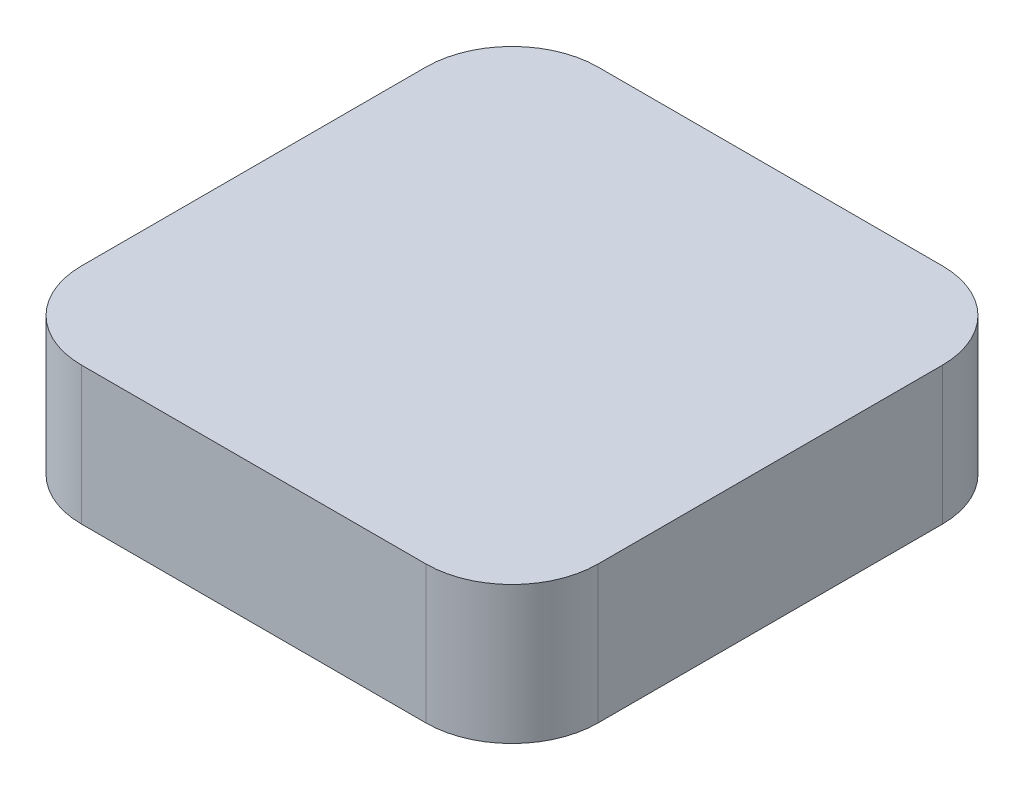
ISO-10303-21;
HEADER;
FILE_DESCRIPTION(('STEP AP214'),'2;1');
FILE_NAME('part.step','',(''),(''),'','','');
FILE_SCHEMA(('AUTOMOTIVE_DESIGN { 1 0 10303 214 1 1 1 1 }'));
ENDSEC;
DATA;
#1=APPLICATION_CONTEXT('core data for automotive mechanical design processes');
#2=APPLICATION_PROTOCOL_DEFINITION('international standard','automotive_design',2000,#1);
#3=PRODUCT_CONTEXT('',#1,'mechanical');
#4=PRODUCT('Part','Part','',(#3));
#5=PRODUCT_RELATED_PRODUCT_CATEGORY('part','',(#4));
#6=PRODUCT_DEFINITION_FORMATION('','',#4);
#7=PRODUCT_DEFINITION_CONTEXT('part definition',#1,'design');
#8=PRODUCT_DEFINITION('design','',#6,#7);
#9=PRODUCT_DEFINITION_SHAPE('','',#8);
#10=(LENGTH_UNIT() NAMED_UNIT(*) SI_UNIT(.MILLI.,.METRE.));
#11=(NAMED_UNIT(*) PLANE_ANGLE_UNIT() SI_UNIT($,.RADIAN.));
#12=(NAMED_UNIT(*) SI_UNIT($,.STERADIAN.) SOLID_ANGLE_UNIT());
#13=UNCERTAINTY_MEASURE_WITH_UNIT(LENGTH_MEASURE(1.E-05),#10,'distance_accuracy_value','');
#14=(GEOMETRIC_REPRESENTATION_CONTEXT(3) GLOBAL_UNCERTAINTY_ASSIGNED_CONTEXT((#13)) GLOBAL_UNIT_ASSIGNED_CONTEXT((#10,
#11,#12)) REPRESENTATION_CONTEXT('',''));
#15=CARTESIAN_POINT('',(0.,0.,0.));
#16=DIRECTION('',(0.,0.,1.));
#17=DIRECTION('',(1.,0.,0.));
#18=AXIS2_PLACEMENT_3D('',#15,#16,#17);
#19=CARTESIAN_POINT('',(5.,4.,5.));
#20=DIRECTION('',(0.,-1.,0.));
#21=DIRECTION('',(0.,0.,-1.));
#22=AXIS2_PLACEMENT_3D('',#19,#20,#21);
#23=CYLINDRICAL_SURFACE('',#22,2.5);
#24=CARTESIAN_POINT('',(5.,0.,5.));
#25=DIRECTION('',(0.,1.,0.));
#26=DIRECTION('',(0.,0.,-1.));
#27=AXIS2_PLACEMENT_3D('',#24,#25,#26);
#28=CIRCLE('',#27,2.5);
#29=CARTESIAN_POINT('',(4.99999999999998,0.,7.5));
#30=VERTEX_POINT('',#29);
#31=CARTESIAN_POINT('',(7.5,0.,4.99999999999998));
#32=VERTEX_POINT('',#31);
#33=EDGE_CURVE('E134',#30,#32,#28,.T.);
#34=ORIENTED_EDGE('',*,*,#33,.T.);
#35=DIRECTION('',(0.,-1.,0.));
#36=VECTOR('',#35,1.);
#37=CARTESIAN_POINT('',(7.5,4.,4.99999999999998));
#38=LINE('',#37,#36);
#39=CARTESIAN_POINT('',(7.5,4.,4.99999999999998));
#40=VERTEX_POINT('',#39);
#41=EDGE_CURVE('E11',#40,#32,#38,.T.);
#42=ORIENTED_EDGE('',*,*,#41,.F.);
#43=CARTESIAN_POINT('',(5.,4.,5.));
#44=DIRECTION('',(0.,1.,0.));
#45=DIRECTION('',(0.,0.,-1.));
#46=AXIS2_PLACEMENT_3D('',#43,#44,#45);
#47=CIRCLE('',#46,2.5);
#48=CARTESIAN_POINT('',(4.99999999999998,4.,7.5));
#49=VERTEX_POINT('',#48);
#50=EDGE_CURVE('E148',#49,#40,#47,.T.);
#51=ORIENTED_EDGE('',*,*,#50,.F.);
#52=DIRECTION('',(0.,-1.,0.));
#53=VECTOR('',#52,1.);
#54=CARTESIAN_POINT('',(4.99999999999998,4.,7.5));
#55=LINE('',#54,#53);
#56=EDGE_CURVE('E130',#49,#30,#55,.T.);
#57=ORIENTED_EDGE('',*,*,#56,.T.);
#58=EDGE_LOOP('',(#34,#42,#51,#57));
#59=FACE_BOUND('',#58,.T.);
#60=ADVANCED_FACE('F38',(#59),#23,.T.);
#61=CARTESIAN_POINT('',(7.5,4.,-4.99999999999998));
#62=DIRECTION('',(-1.,0.,0.));
#63=DIRECTION('',(0.,0.,1.));
#64=AXIS2_PLACEMENT_3D('',#61,#62,#63);
#65=PLANE('',#64);
#66=DIRECTION('',(0.,0.,-1.));
#67=VECTOR('',#66,1.);
#68=CARTESIAN_POINT('',(7.5,0.,-4.99999999999998));
#69=LINE('',#68,#67);
#70=CARTESIAN_POINT('',(7.5,0.,-4.99999999999998));
#71=VERTEX_POINT('',#70);
#72=EDGE_CURVE('E137',#32,#71,#69,.T.);
#73=ORIENTED_EDGE('',*,*,#72,.T.);
#74=DIRECTION('',(0.,-1.,0.));
#75=VECTOR('',#74,1.);
#76=CARTESIAN_POINT('',(7.5,4.,-4.99999999999998));
#77=LINE('',#76,#75);
#78=CARTESIAN_POINT('',(7.5,4.,-4.99999999999998));
#79=VERTEX_POINT('',#78);
#80=EDGE_CURVE('E46',#79,#71,#77,.T.);
#81=ORIENTED_EDGE('',*,*,#80,.F.);
#82=DIRECTION('',(0.,0.,-1.));
#83=VECTOR('',#82,1.);
#84=CARTESIAN_POINT('',(7.5,4.,-4.99999999999998));
#85=LINE('',#84,#83);
#86=EDGE_CURVE('E97',#40,#79,#85,.T.);
#87=ORIENTED_EDGE('',*,*,#86,.F.);
#88=ORIENTED_EDGE('',*,*,#41,.T.);
#89=EDGE_LOOP('',(#73,#81,#87,#88));
#90=FACE_BOUND('',#89,.T.);
#91=ADVANCED_FACE('F183',(#90),#65,.F.);
#92=CARTESIAN_POINT('',(5.,4.,-5.));
#93=DIRECTION('',(0.,-1.,0.));
#94=DIRECTION('',(0.,0.,-1.));
#95=AXIS2_PLACEMENT_3D('',#92,#93,#94);
#96=CYLINDRICAL_SURFACE('',#95,2.5);
#97=CARTESIAN_POINT('',(5.,0.,-5.));
#98=DIRECTION('',(0.,1.,0.));
#99=DIRECTION('',(0.,0.,1.));
#100=AXIS2_PLACEMENT_3D('',#97,#98,#99);
#101=CIRCLE('',#100,2.5);
#102=CARTESIAN_POINT('',(4.99999999999998,0.,-7.5));
#103=VERTEX_POINT('',#102);
#104=EDGE_CURVE('E139',#71,#103,#101,.T.);
#105=ORIENTED_EDGE('',*,*,#104,.T.);
#106=DIRECTION('',(0.,-1.,0.));
#107=VECTOR('',#106,1.);
#108=CARTESIAN_POINT('',(4.99999999999998,4.,-7.5));
#109=LINE('',#108,#107);
#110=CARTESIAN_POINT('',(4.99999999999998,4.,-7.5));
#111=VERTEX_POINT('',#110);
#112=EDGE_CURVE('E155',#111,#103,#109,.T.);
#113=ORIENTED_EDGE('',*,*,#112,.F.);
#114=CARTESIAN_POINT('',(5.,4.,-5.));
#115=DIRECTION('',(0.,1.,0.));
#116=DIRECTION('',(0.,0.,1.));
#117=AXIS2_PLACEMENT_3D('',#114,#115,#116);
#118=CIRCLE('',#117,2.5);
#119=EDGE_CURVE('E163',#79,#111,#118,.T.);
#120=ORIENTED_EDGE('',*,*,#119,.F.);
#121=ORIENTED_EDGE('',*,*,#80,.T.);
#122=EDGE_LOOP('',(#105,#113,#120,#121));
#123=FACE_BOUND('',#122,.T.);
#124=ADVANCED_FACE('F161',(#123),#96,.T.);
#125=CARTESIAN_POINT('',(-4.99999999999998,4.,-7.5));
#126=DIRECTION('',(0.,0.,1.));
#127=DIRECTION('',(1.,0.,0.));
#128=AXIS2_PLACEMENT_3D('',#125,#126,#127);
#129=PLANE('',#128);
#130=DIRECTION('',(-1.,0.,0.));
#131=VECTOR('',#130,1.);
#132=CARTESIAN_POINT('',(-4.99999999999998,0.,-7.5));
#133=LINE('',#132,#131);
#134=CARTESIAN_POINT('',(-4.99999999999998,0.,-7.5));
#135=VERTEX_POINT('',#134);
#136=EDGE_CURVE('E141',#103,#135,#133,.T.);
#137=ORIENTED_EDGE('',*,*,#136,.T.);
#138=DIRECTION('',(0.,-1.,0.));
#139=VECTOR('',#138,1.);
#140=CARTESIAN_POINT('',(-4.99999999999998,4.,-7.5));
#141=LINE('',#140,#139);
#142=CARTESIAN_POINT('',(-4.99999999999998,4.,-7.5));
#143=VERTEX_POINT('',#142);
#144=EDGE_CURVE('E152',#143,#135,#141,.T.);
#145=ORIENTED_EDGE('',*,*,#144,.F.);
#146=DIRECTION('',(-1.,0.,0.));
#147=VECTOR('',#146,1.);
#148=CARTESIAN_POINT('',(-4.99999999999998,4.,-7.5));
#149=LINE('',#148,#147);
#150=EDGE_CURVE('E175',#111,#143,#149,.T.);
#151=ORIENTED_EDGE('',*,*,#150,.F.);
#152=ORIENTED_EDGE('',*,*,#112,.T.);
#153=EDGE_LOOP('',(#137,#145,#151,#152));
#154=FACE_BOUND('',#153,.T.);
#155=ADVANCED_FACE('F171',(#154),#129,.F.);
#156=CARTESIAN_POINT('',(-5.,4.,-5.));
#157=DIRECTION('',(0.,-1.,0.));
#158=DIRECTION('',(0.,0.,-1.));
#159=AXIS2_PLACEMENT_3D('',#156,#157,#158);
#160=CYLINDRICAL_SURFACE('',#159,2.5);
#161=CARTESIAN_POINT('',(-5.,0.,-5.));
#162=DIRECTION('',(0.,1.,0.));
#163=DIRECTION('',(0.,0.,1.));
#164=AXIS2_PLACEMENT_3D('',#161,#162,#163);
#165=CIRCLE('',#164,2.5);
#166=CARTESIAN_POINT('',(-7.5,0.,-4.99999999999998));
#167=VERTEX_POINT('',#166);
#168=EDGE_CURVE('E143',#135,#167,#165,.T.);
#169=ORIENTED_EDGE('',*,*,#168,.T.);
#170=DIRECTION('',(0.,-1.,0.));
#171=VECTOR('',#170,1.);
#172=CARTESIAN_POINT('',(-7.5,4.,-4.99999999999998));
#173=LINE('',#172,#171);
#174=CARTESIAN_POINT('',(-7.5,4.,-4.99999999999998));
#175=VERTEX_POINT('',#174);
#176=EDGE_CURVE('E125',#175,#167,#173,.T.);
#177=ORIENTED_EDGE('',*,*,#176,.F.);
#178=CARTESIAN_POINT('',(-5.,4.,-5.));
#179=DIRECTION('',(0.,1.,0.));
#180=DIRECTION('',(0.,0.,1.));
#181=AXIS2_PLACEMENT_3D('',#178,#179,#180);
#182=CIRCLE('',#181,2.5);
#183=EDGE_CURVE('E116',#143,#175,#182,.T.);
#184=ORIENTED_EDGE('',*,*,#183,.F.);
#185=ORIENTED_EDGE('',*,*,#144,.T.);
#186=EDGE_LOOP('',(#169,#177,#184,#185));
#187=FACE_BOUND('',#186,.T.);
#188=ADVANCED_FACE('F174',(#187),#160,.T.);
#189=CARTESIAN_POINT('',(-7.5,4.,-4.99999999999998));
#190=DIRECTION('',(1.,0.,0.));
#191=DIRECTION('',(0.,0.,-1.));
#192=AXIS2_PLACEMENT_3D('',#189,#190,#191);
#193=PLANE('',#192);
#194=DIRECTION('',(0.,0.,1.));
#195=VECTOR('',#194,1.);
#196=CARTESIAN_POINT('',(-7.5,0.,-4.99999999999998));
#197=LINE('',#196,#195);
#198=CARTESIAN_POINT('',(-7.5,0.,4.99999999999998));
#199=VERTEX_POINT('',#198);
#200=EDGE_CURVE('E124',#167,#199,#197,.T.);
#201=ORIENTED_EDGE('',*,*,#200,.T.);
#202=DIRECTION('',(0.,-1.,0.));
#203=VECTOR('',#202,1.);
#204=CARTESIAN_POINT('',(-7.5,4.,4.99999999999998));
#205=LINE('',#204,#203);
#206=CARTESIAN_POINT('',(-7.5,4.,4.99999999999998));
#207=VERTEX_POINT('',#206);
#208=EDGE_CURVE('E121',#207,#199,#205,.T.);
#209=ORIENTED_EDGE('',*,*,#208,.F.);
#210=DIRECTION('',(0.,0.,1.));
#211=VECTOR('',#210,1.);
#212=CARTESIAN_POINT('',(-7.5,4.,-4.99999999999998));
#213=LINE('',#212,#211);
#214=EDGE_CURVE('E110',#175,#207,#213,.T.);
#215=ORIENTED_EDGE('',*,*,#214,.F.);
#216=ORIENTED_EDGE('',*,*,#176,.T.);
#217=EDGE_LOOP('',(#201,#209,#215,#216));
#218=FACE_BOUND('',#217,.T.);
#219=ADVANCED_FACE('F122',(#218),#193,.F.);
#220=CARTESIAN_POINT('',(-5.,4.,5.));
#221=DIRECTION('',(0.,-1.,0.));
#222=DIRECTION('',(0.,0.,-1.));
#223=AXIS2_PLACEMENT_3D('',#220,#221,#222);
#224=CYLINDRICAL_SURFACE('',#223,2.5);
#225=CARTESIAN_POINT('',(-5.,0.,5.));
#226=DIRECTION('',(0.,1.,0.));
#227=DIRECTION('',(0.,0.,-1.));
#228=AXIS2_PLACEMENT_3D('',#225,#226,#227);
#229=CIRCLE('',#228,2.5);
#230=CARTESIAN_POINT('',(-4.99999999999998,0.,7.5));
#231=VERTEX_POINT('',#230);
#232=EDGE_CURVE('E83',#199,#231,#229,.T.);
#233=ORIENTED_EDGE('',*,*,#232,.T.);
#234=DIRECTION('',(0.,-1.,0.));
#235=VECTOR('',#234,1.);
#236=CARTESIAN_POINT('',(-4.99999999999998,4.,7.5));
#237=LINE('',#236,#235);
#238=CARTESIAN_POINT('',(-4.99999999999998,4.,7.5));
#239=VERTEX_POINT('',#238);
#240=EDGE_CURVE('E126',#239,#231,#237,.T.);
#241=ORIENTED_EDGE('',*,*,#240,.F.);
#242=CARTESIAN_POINT('',(-5.,4.,5.));
#243=DIRECTION('',(0.,1.,0.));
#244=DIRECTION('',(0.,0.,-1.));
#245=AXIS2_PLACEMENT_3D('',#242,#243,#244);
#246=CIRCLE('',#245,2.5);
#247=EDGE_CURVE('E114',#207,#239,#246,.T.);
#248=ORIENTED_EDGE('',*,*,#247,.F.);
#249=ORIENTED_EDGE('',*,*,#208,.T.);
#250=EDGE_LOOP('',(#233,#241,#248,#249));
#251=FACE_BOUND('',#250,.T.);
#252=ADVANCED_FACE('F128',(#251),#224,.T.);
#253=CARTESIAN_POINT('',(-4.99999999999998,4.,7.5));
#254=DIRECTION('',(0.,0.,-1.));
#255=DIRECTION('',(-1.,0.,0.));
#256=AXIS2_PLACEMENT_3D('',#253,#254,#255);
#257=PLANE('',#256);
#258=DIRECTION('',(1.,0.,0.));
#259=VECTOR('',#258,1.);
#260=CARTESIAN_POINT('',(-4.99999999999998,0.,7.5));
#261=LINE('',#260,#259);
#262=EDGE_CURVE('E89',#231,#30,#261,.T.);
#263=ORIENTED_EDGE('',*,*,#262,.T.);
#264=ORIENTED_EDGE('',*,*,#56,.F.);
#265=DIRECTION('',(1.,0.,0.));
#266=VECTOR('',#265,1.);
#267=CARTESIAN_POINT('',(-4.99999999999998,4.,7.5));
#268=LINE('',#267,#266);
#269=EDGE_CURVE('E54',#239,#49,#268,.T.);
#270=ORIENTED_EDGE('',*,*,#269,.F.);
#271=ORIENTED_EDGE('',*,*,#240,.T.);
#272=EDGE_LOOP('',(#263,#264,#270,#271));
#273=FACE_BOUND('',#272,.T.);
#274=ADVANCED_FACE('F199',(#273),#257,.F.);
#275=CARTESIAN_POINT('',(5.,4.,5.));
#276=DIRECTION('',(0.,-1.,0.));
#277=DIRECTION('',(0.,0.,-1.));
#278=AXIS2_PLACEMENT_3D('',#275,#276,#277);
#279=PLANE('',#278);
#280=ORIENTED_EDGE('',*,*,#50,.T.);
#281=ORIENTED_EDGE('',*,*,#86,.T.);
#282=ORIENTED_EDGE('',*,*,#119,.T.);
#283=ORIENTED_EDGE('',*,*,#150,.T.);
#284=ORIENTED_EDGE('',*,*,#183,.T.);
#285=ORIENTED_EDGE('',*,*,#214,.T.);
#286=ORIENTED_EDGE('',*,*,#247,.T.);
#287=ORIENTED_EDGE('',*,*,#269,.T.);
#288=EDGE_LOOP('',(#280,#281,#282,#283,#284,#285,#286,#287));
#289=FACE_BOUND('',#288,.T.);
#290=ADVANCED_FACE('F112',(#289),#279,.F.);
#291=CARTESIAN_POINT('',(5.,0.,5.));
#292=DIRECTION('',(0.,-1.,0.));
#293=DIRECTION('',(0.,0.,-1.));
#294=AXIS2_PLACEMENT_3D('',#291,#292,#293);
#295=PLANE('',#294);
#296=ORIENTED_EDGE('',*,*,#33,.F.);
#297=ORIENTED_EDGE('',*,*,#262,.F.);
#298=ORIENTED_EDGE('',*,*,#232,.F.);
#299=ORIENTED_EDGE('',*,*,#200,.F.);
#300=ORIENTED_EDGE('',*,*,#168,.F.);
#301=ORIENTED_EDGE('',*,*,#136,.F.);
#302=ORIENTED_EDGE('',*,*,#104,.F.);
#303=ORIENTED_EDGE('',*,*,#72,.F.);
#304=EDGE_LOOP('',(#296,#297,#298,#299,#300,#301,#302,#303));
#305=FACE_BOUND('',#304,.T.);
#306=ADVANCED_FACE('F167',(#305),#295,.T.);
#307=CLOSED_SHELL('',(#60,#91,#124,#155,#188,#219,#252,#274,#290,#306));
#308=MANIFOLD_SOLID_BREP('B2',#307);
#309=ADVANCED_BREP_SHAPE_REPRESENTATION('',(#18,#308),#14);
#310=SHAPE_DEFINITION_REPRESENTATION(#9,#309);
ENDSEC;
END-ISO-10303-21;
